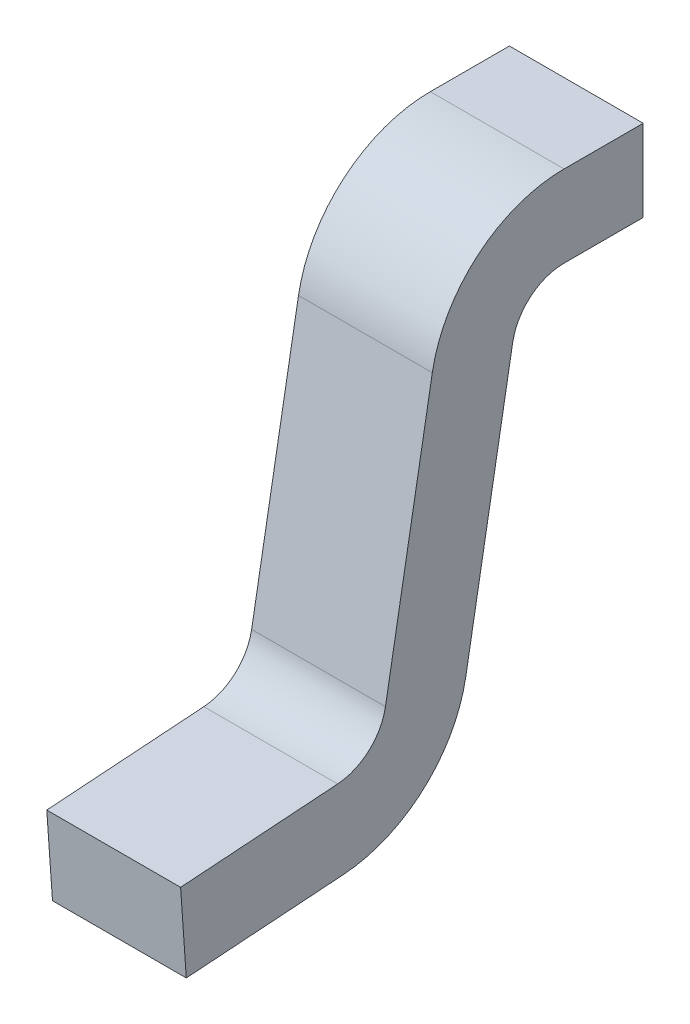
ISO-10303-21;
HEADER;
FILE_DESCRIPTION(('STEP AP214'),'2;1');
FILE_NAME('part.step','',(''),(''),'','','');
FILE_SCHEMA(('AUTOMOTIVE_DESIGN { 1 0 10303 214 1 1 1 1 }'));
ENDSEC;
DATA;
#1=APPLICATION_CONTEXT('core data for automotive mechanical design processes');
#2=APPLICATION_PROTOCOL_DEFINITION('international standard','automotive_design',2000,#1);
#3=PRODUCT_CONTEXT('',#1,'mechanical');
#4=PRODUCT('Part','Part','',(#3));
#5=PRODUCT_RELATED_PRODUCT_CATEGORY('part','',(#4));
#6=PRODUCT_DEFINITION_FORMATION('','',#4);
#7=PRODUCT_DEFINITION_CONTEXT('part definition',#1,'design');
#8=PRODUCT_DEFINITION('design','',#6,#7);
#9=PRODUCT_DEFINITION_SHAPE('','',#8);
#10=(LENGTH_UNIT() NAMED_UNIT(*) SI_UNIT(.MILLI.,.METRE.));
#11=(NAMED_UNIT(*) PLANE_ANGLE_UNIT() SI_UNIT($,.RADIAN.));
#12=(NAMED_UNIT(*) SI_UNIT($,.STERADIAN.) SOLID_ANGLE_UNIT());
#13=UNCERTAINTY_MEASURE_WITH_UNIT(LENGTH_MEASURE(1.E-05),#10,'distance_accuracy_value','');
#14=(GEOMETRIC_REPRESENTATION_CONTEXT(3) GLOBAL_UNCERTAINTY_ASSIGNED_CONTEXT((#13)) GLOBAL_UNIT_ASSIGNED_CONTEXT((#10,
#11,#12)) REPRESENTATION_CONTEXT('',''));
#15=CARTESIAN_POINT('',(0.,0.,0.));
#16=DIRECTION('',(0.,0.,1.));
#17=DIRECTION('',(1.,0.,0.));
#18=AXIS2_PLACEMENT_3D('',#15,#16,#17);
#19=CARTESIAN_POINT('',(-0.205,0.,0.));
#20=DIRECTION('',(1.,0.,0.));
#21=DIRECTION('',(0.,0.,-1.));
#22=AXIS2_PLACEMENT_3D('',#19,#20,#21);
#23=PLANE('',#22);
#24=CARTESIAN_POINT('',(-0.205,0.1926532032769,0.3823549532155));
#25=DIRECTION('',(-1.,0.,0.));
#26=DIRECTION('',(0.,-0.173648177666902,-0.984807753012213));
#27=AXIS2_PLACEMENT_3D('',#24,#25,#26);
#28=CIRCLE('',#27,0.41);
#29=CARTESIAN_POINT('',(-0.205,0.1214574504335,-0.02141622551949));
#30=VERTEX_POINT('',#29);
#31=CARTESIAN_POINT('',(-0.205,-0.2163480573296,0.3537547989804));
#32=VERTEX_POINT('',#31);
#33=EDGE_CURVE('E11',#30,#32,#28,.T.);
#34=ORIENTED_EDGE('',*,*,#33,.T.);
#35=DIRECTION('',(0.,0.0697564737441317,-0.997564050259824));
#36=VECTOR('',#35,1.);
#37=CARTESIAN_POINT('',(-0.205,-0.25,0.835));
#38=LINE('',#37,#36);
#39=CARTESIAN_POINT('',(-0.205,-0.25,0.835));
#40=VERTEX_POINT('',#39);
#41=EDGE_CURVE('E195',#40,#32,#38,.T.);
#42=ORIENTED_EDGE('',*,*,#41,.F.);
#43=DIRECTION('',(0.,-0.997564050259824,-0.069756473744132));
#44=VECTOR('',#43,1.);
#45=CARTESIAN_POINT('',(-0.205,-0.0006089874350439,0.852439118436));
#46=LINE('',#45,#44);
#47=CARTESIAN_POINT('',(-0.205,-0.0006089874350439,0.852439118436));
#48=VERTEX_POINT('',#47);
#49=EDGE_CURVE('E187',#48,#40,#46,.T.);
#50=ORIENTED_EDGE('',*,*,#49,.F.);
#51=DIRECTION('',(0.,-0.0697564737441316,0.997564050259824));
#52=VECTOR('',#51,1.);
#53=CARTESIAN_POINT('',(-0.205,0.03304295523537,0.3711939174165));
#54=LINE('',#53,#52);
#55=CARTESIAN_POINT('',(-0.205,0.03304295523537,0.3711939174165));
#56=VERTEX_POINT('',#55);
#57=EDGE_CURVE('E179',#56,#48,#54,.T.);
#58=ORIENTED_EDGE('',*,*,#57,.F.);
#59=CARTESIAN_POINT('',(-0.205,0.1926532032769,0.3823549532155));
#60=DIRECTION('',(1.,0.,0.));
#61=DIRECTION('',(0.,-0.997564050259824,-0.0697564737441317));
#62=AXIS2_PLACEMENT_3D('',#59,#60,#61);
#63=CIRCLE('',#62,0.16);
#64=CARTESIAN_POINT('',(-0.205,0.1648694948502,0.2247857127336));
#65=VERTEX_POINT('',#64);
#66=EDGE_CURVE('E167',#56,#65,#63,.T.);
#67=ORIENTED_EDGE('',*,*,#66,.T.);
#68=DIRECTION('',(0.,0.984807753012213,-0.173648177666902));
#69=VECTOR('',#68,1.);
#70=CARTESIAN_POINT('',(-0.205,0.1648694948502,0.2247857127336));
#71=LINE('',#70,#69);
#72=CARTESIAN_POINT('',(-0.205,0.9791957528434,0.08119802234999));
#73=VERTEX_POINT('',#72);
#74=EDGE_CURVE('E156',#65,#73,#71,.T.);
#75=ORIENTED_EDGE('',*,*,#74,.T.);
#76=CARTESIAN_POINT('',(-0.205,0.908,-0.322573156385));
#77=DIRECTION('',(-1.,0.,0.));
#78=DIRECTION('',(0.,0.173648177666902,0.984807753012213));
#79=AXIS2_PLACEMENT_3D('',#76,#77,#78);
#80=CIRCLE('',#79,0.41);
#81=CARTESIAN_POINT('',(-0.205,1.318,-0.322573156385));
#82=VERTEX_POINT('',#81);
#83=EDGE_CURVE('E148',#73,#82,#80,.T.);
#84=ORIENTED_EDGE('',*,*,#83,.T.);
#85=DIRECTION('',(0.,0.,1.));
#86=VECTOR('',#85,1.);
#87=CARTESIAN_POINT('',(-0.205,1.318,-0.565));
#88=LINE('',#87,#86);
#89=CARTESIAN_POINT('',(-0.205,1.318,-0.565));
#90=VERTEX_POINT('',#89);
#91=EDGE_CURVE('E137',#90,#82,#88,.T.);
#92=ORIENTED_EDGE('',*,*,#91,.F.);
#93=DIRECTION('',(0.,1.,0.));
#94=VECTOR('',#93,1.);
#95=CARTESIAN_POINT('',(-0.205,1.068,-0.565));
#96=LINE('',#95,#94);
#97=CARTESIAN_POINT('',(-0.205,1.068,-0.565));
#98=VERTEX_POINT('',#97);
#99=EDGE_CURVE('E112',#98,#90,#96,.T.);
#100=ORIENTED_EDGE('',*,*,#99,.F.);
#101=DIRECTION('',(0.,0.,-1.));
#102=VECTOR('',#101,1.);
#103=CARTESIAN_POINT('',(-0.205,1.068,-0.322573156385));
#104=LINE('',#103,#102);
#105=CARTESIAN_POINT('',(-0.205,1.068,-0.322573156385));
#106=VERTEX_POINT('',#105);
#107=EDGE_CURVE('E105',#106,#98,#104,.T.);
#108=ORIENTED_EDGE('',*,*,#107,.F.);
#109=CARTESIAN_POINT('',(-0.205,0.908,-0.322573156385));
#110=DIRECTION('',(1.,0.,0.));
#111=DIRECTION('',(0.,1.,0.));
#112=AXIS2_PLACEMENT_3D('',#109,#110,#111);
#113=CIRCLE('',#112,0.16);
#114=CARTESIAN_POINT('',(-0.205,0.9357837084267,-0.1650039159031));
#115=VERTEX_POINT('',#114);
#116=EDGE_CURVE('E116',#106,#115,#113,.T.);
#117=ORIENTED_EDGE('',*,*,#116,.T.);
#118=DIRECTION('',(0.,-0.984807753012213,0.173648177666902));
#119=VECTOR('',#118,1.);
#120=CARTESIAN_POINT('',(-0.205,0.9357837084267,-0.1650039159031));
#121=LINE('',#120,#119);
#122=EDGE_CURVE('E190',#115,#30,#121,.T.);
#123=ORIENTED_EDGE('',*,*,#122,.T.);
#124=EDGE_LOOP('',(#34,#42,#50,#58,#67,#75,#84,#92,#100,#108,#117,#123));
#125=FACE_BOUND('',#124,.T.);
#126=ADVANCED_FACE('F17',(#125),#23,.F.);
#127=CARTESIAN_POINT('',(-0.205,-0.1940031679098,0.03420799284542));
#128=DIRECTION('',(0.,-0.173648177666902,-0.984807753012213));
#129=DIRECTION('',(0.,0.984807753012213,-0.173648177666902));
#130=AXIS2_PLACEMENT_3D('',#127,#128,#129);
#131=PLANE('',#130);
#132=DIRECTION('',(1.,0.,0.));
#133=VECTOR('',#132,1.);
#134=CARTESIAN_POINT('',(-0.205,0.1214574504335,-0.02141622551949));
#135=LINE('',#134,#133);
#136=CARTESIAN_POINT('',(0.205,0.1214574504335,-0.02141622551949));
#137=VERTEX_POINT('',#136);
#138=EDGE_CURVE('E24',#30,#137,#135,.T.);
#139=ORIENTED_EDGE('',*,*,#138,.F.);
#140=ORIENTED_EDGE('',*,*,#122,.F.);
#141=DIRECTION('',(1.,0.,0.));
#142=VECTOR('',#141,1.);
#143=CARTESIAN_POINT('',(-0.205,0.9357837084267,-0.1650039159031));
#144=LINE('',#143,#142);
#145=CARTESIAN_POINT('',(0.205,0.9357837084267,-0.1650039159031));
#146=VERTEX_POINT('',#145);
#147=EDGE_CURVE('E123',#115,#146,#144,.T.);
#148=ORIENTED_EDGE('',*,*,#147,.T.);
#149=DIRECTION('',(0.,0.984807753012213,-0.173648177666902));
#150=VECTOR('',#149,1.);
#151=CARTESIAN_POINT('',(0.205,0.1214574504335,-0.02141622551949));
#152=LINE('',#151,#150);
#153=EDGE_CURVE('E169',#137,#146,#152,.T.);
#154=ORIENTED_EDGE('',*,*,#153,.F.);
#155=EDGE_LOOP('',(#139,#140,#148,#154));
#156=FACE_BOUND('',#155,.T.);
#157=ADVANCED_FACE('F235',(#156),#131,.T.);
#158=CARTESIAN_POINT('',(0.205,0.,0.));
#159=DIRECTION('',(1.,0.,0.));
#160=DIRECTION('',(0.,0.,-1.));
#161=AXIS2_PLACEMENT_3D('',#158,#159,#160);
#162=PLANE('',#161);
#163=CARTESIAN_POINT('',(0.205,0.1926532032769,0.3823549532155));
#164=DIRECTION('',(1.,0.,0.));
#165=DIRECTION('',(0.,-0.997564050259824,-0.0697564737441317));
#166=AXIS2_PLACEMENT_3D('',#163,#164,#165);
#167=CIRCLE('',#166,0.16);
#168=CARTESIAN_POINT('',(0.205,0.03304295523537,0.3711939174165));
#169=VERTEX_POINT('',#168);
#170=CARTESIAN_POINT('',(0.205,0.1648694948502,0.2247857127336));
#171=VERTEX_POINT('',#170);
#172=EDGE_CURVE('E192',#169,#171,#167,.T.);
#173=ORIENTED_EDGE('',*,*,#172,.F.);
#174=DIRECTION('',(0.,-0.0697564737441316,0.997564050259824));
#175=VECTOR('',#174,1.);
#176=CARTESIAN_POINT('',(0.205,0.03304295523537,0.3711939174165));
#177=LINE('',#176,#175);
#178=CARTESIAN_POINT('',(0.205,-0.0006089874350439,0.852439118436));
#179=VERTEX_POINT('',#178);
#180=EDGE_CURVE('E183',#169,#179,#177,.T.);
#181=ORIENTED_EDGE('',*,*,#180,.T.);
#182=DIRECTION('',(0.,-0.997564050259824,-0.069756473744132));
#183=VECTOR('',#182,1.);
#184=CARTESIAN_POINT('',(0.205,-0.0006089874350439,0.852439118436));
#185=LINE('',#184,#183);
#186=CARTESIAN_POINT('',(0.205,-0.25,0.835));
#187=VERTEX_POINT('',#186);
#188=EDGE_CURVE('E172',#179,#187,#185,.T.);
#189=ORIENTED_EDGE('',*,*,#188,.T.);
#190=DIRECTION('',(0.,0.0697564737441317,-0.997564050259824));
#191=VECTOR('',#190,1.);
#192=CARTESIAN_POINT('',(0.205,-0.25,0.835));
#193=LINE('',#192,#191);
#194=CARTESIAN_POINT('',(0.205,-0.2163480573296,0.3537547989804));
#195=VERTEX_POINT('',#194);
#196=EDGE_CURVE('E159',#187,#195,#193,.T.);
#197=ORIENTED_EDGE('',*,*,#196,.T.);
#198=CARTESIAN_POINT('',(0.205,0.1926532032769,0.3823549532155));
#199=DIRECTION('',(-1.,0.,0.));
#200=DIRECTION('',(0.,-0.173648177666902,-0.984807753012213));
#201=AXIS2_PLACEMENT_3D('',#198,#199,#200);
#202=CIRCLE('',#201,0.41);
#203=EDGE_CURVE('E145',#137,#195,#202,.T.);
#204=ORIENTED_EDGE('',*,*,#203,.F.);
#205=ORIENTED_EDGE('',*,*,#153,.T.);
#206=CARTESIAN_POINT('',(0.205,0.908,-0.322573156385));
#207=DIRECTION('',(1.,0.,0.));
#208=DIRECTION('',(0.,1.,0.));
#209=AXIS2_PLACEMENT_3D('',#206,#207,#208);
#210=CIRCLE('',#209,0.16);
#211=CARTESIAN_POINT('',(0.205,1.068,-0.322573156385));
#212=VERTEX_POINT('',#211);
#213=EDGE_CURVE('E135',#212,#146,#210,.T.);
#214=ORIENTED_EDGE('',*,*,#213,.F.);
#215=DIRECTION('',(0.,0.,-1.));
#216=VECTOR('',#215,1.);
#217=CARTESIAN_POINT('',(0.205,1.068,-0.322573156385));
#218=LINE('',#217,#216);
#219=CARTESIAN_POINT('',(0.205,1.068,-0.565));
#220=VERTEX_POINT('',#219);
#221=EDGE_CURVE('E107',#212,#220,#218,.T.);
#222=ORIENTED_EDGE('',*,*,#221,.T.);
#223=DIRECTION('',(0.,1.,0.));
#224=VECTOR('',#223,1.);
#225=CARTESIAN_POINT('',(0.205,1.068,-0.565));
#226=LINE('',#225,#224);
#227=CARTESIAN_POINT('',(0.205,1.318,-0.565));
#228=VERTEX_POINT('',#227);
#229=EDGE_CURVE('E140',#220,#228,#226,.T.);
#230=ORIENTED_EDGE('',*,*,#229,.T.);
#231=DIRECTION('',(0.,0.,1.));
#232=VECTOR('',#231,1.);
#233=CARTESIAN_POINT('',(0.205,1.318,-0.565));
#234=LINE('',#233,#232);
#235=CARTESIAN_POINT('',(0.205,1.318,-0.322573156385));
#236=VERTEX_POINT('',#235);
#237=EDGE_CURVE('E151',#228,#236,#234,.T.);
#238=ORIENTED_EDGE('',*,*,#237,.T.);
#239=CARTESIAN_POINT('',(0.205,0.908,-0.322573156385));
#240=DIRECTION('',(-1.,0.,0.));
#241=DIRECTION('',(0.,0.173648177666902,0.984807753012213));
#242=AXIS2_PLACEMENT_3D('',#239,#240,#241);
#243=CIRCLE('',#242,0.41);
#244=CARTESIAN_POINT('',(0.205,0.9791957528434,0.08119802234999));
#245=VERTEX_POINT('',#244);
#246=EDGE_CURVE('E177',#245,#236,#243,.T.);
#247=ORIENTED_EDGE('',*,*,#246,.F.);
#248=DIRECTION('',(0.,-0.984807753012213,0.173648177666902));
#249=VECTOR('',#248,1.);
#250=CARTESIAN_POINT('',(0.205,0.9791957528434,0.08119802234999));
#251=LINE('',#250,#249);
#252=EDGE_CURVE('E174',#245,#171,#251,.T.);
#253=ORIENTED_EDGE('',*,*,#252,.T.);
#254=EDGE_LOOP('',(#173,#181,#189,#197,#204,#205,#214,#222,#230,#238,#247,#253));
#255=FACE_BOUND('',#254,.T.);
#256=ADVANCED_FACE('F228',(#255),#162,.T.);
#257=CARTESIAN_POINT('',(-0.205,0.04341204441673,0.2462019382531));
#258=DIRECTION('',(0.,0.173648177666902,0.984807753012213));
#259=DIRECTION('',(0.,-0.984807753012213,0.173648177666902));
#260=AXIS2_PLACEMENT_3D('',#257,#258,#259);
#261=PLANE('',#260);
#262=DIRECTION('',(1.,0.,0.));
#263=VECTOR('',#262,1.);
#264=CARTESIAN_POINT('',(-0.205,0.1648694948502,0.2247857127336));
#265=LINE('',#264,#263);
#266=EDGE_CURVE('E185',#65,#171,#265,.T.);
#267=ORIENTED_EDGE('',*,*,#266,.T.);
#268=ORIENTED_EDGE('',*,*,#252,.F.);
#269=DIRECTION('',(1.,0.,0.));
#270=VECTOR('',#269,1.);
#271=CARTESIAN_POINT('',(-0.205,0.9791957528434,0.08119802234999));
#272=LINE('',#271,#270);
#273=EDGE_CURVE('E161',#73,#245,#272,.T.);
#274=ORIENTED_EDGE('',*,*,#273,.F.);
#275=ORIENTED_EDGE('',*,*,#74,.F.);
#276=EDGE_LOOP('',(#267,#268,#274,#275));
#277=FACE_BOUND('',#276,.T.);
#278=ADVANCED_FACE('F223',(#277),#261,.T.);
#279=CARTESIAN_POINT('',(-0.205,0.908,-0.322573156385));
#280=DIRECTION('',(-1.,0.,0.));
#281=DIRECTION('',(0.,0.173648177666902,0.984807753012213));
#282=AXIS2_PLACEMENT_3D('',#279,#280,#281);
#283=CYLINDRICAL_SURFACE('',#282,0.41);
#284=ORIENTED_EDGE('',*,*,#246,.T.);
#285=DIRECTION('',(1.,0.,0.));
#286=VECTOR('',#285,1.);
#287=CARTESIAN_POINT('',(-0.205,1.318,-0.322573156385));
#288=LINE('',#287,#286);
#289=EDGE_CURVE('E164',#82,#236,#288,.T.);
#290=ORIENTED_EDGE('',*,*,#289,.F.);
#291=ORIENTED_EDGE('',*,*,#83,.F.);
#292=ORIENTED_EDGE('',*,*,#273,.T.);
#293=EDGE_LOOP('',(#284,#290,#291,#292));
#294=FACE_BOUND('',#293,.T.);
#295=ADVANCED_FACE('F226',(#294),#283,.T.);
#296=CARTESIAN_POINT('',(-0.205,1.318,-0.565));
#297=DIRECTION('',(0.,1.,0.));
#298=DIRECTION('',(0.,0.,1.));
#299=AXIS2_PLACEMENT_3D('',#296,#297,#298);
#300=PLANE('',#299);
#301=ORIENTED_EDGE('',*,*,#289,.T.);
#302=ORIENTED_EDGE('',*,*,#237,.F.);
#303=DIRECTION('',(1.,0.,0.));
#304=VECTOR('',#303,1.);
#305=CARTESIAN_POINT('',(-0.205,1.318,-0.565));
#306=LINE('',#305,#304);
#307=EDGE_CURVE('E154',#90,#228,#306,.T.);
#308=ORIENTED_EDGE('',*,*,#307,.F.);
#309=ORIENTED_EDGE('',*,*,#91,.T.);
#310=EDGE_LOOP('',(#301,#302,#308,#309));
#311=FACE_BOUND('',#310,.T.);
#312=ADVANCED_FACE('F232',(#311),#300,.T.);
#313=CARTESIAN_POINT('',(-0.205,1.068,-0.565));
#314=DIRECTION('',(0.,0.,-1.));
#315=DIRECTION('',(0.,1.,0.));
#316=AXIS2_PLACEMENT_3D('',#313,#314,#315);
#317=PLANE('',#316);
#318=ORIENTED_EDGE('',*,*,#307,.T.);
#319=ORIENTED_EDGE('',*,*,#229,.F.);
#320=DIRECTION('',(1.,0.,0.));
#321=VECTOR('',#320,1.);
#322=CARTESIAN_POINT('',(-0.205,1.068,-0.565));
#323=LINE('',#322,#321);
#324=EDGE_CURVE('E143',#98,#220,#323,.T.);
#325=ORIENTED_EDGE('',*,*,#324,.F.);
#326=ORIENTED_EDGE('',*,*,#99,.T.);
#327=EDGE_LOOP('',(#318,#319,#325,#326));
#328=FACE_BOUND('',#327,.T.);
#329=ADVANCED_FACE('F234',(#328),#317,.T.);
#330=CARTESIAN_POINT('',(-0.205,1.068,-0.1883172153966));
#331=DIRECTION('',(0.,-1.,0.));
#332=DIRECTION('',(0.,0.,-1.));
#333=AXIS2_PLACEMENT_3D('',#330,#331,#332);
#334=PLANE('',#333);
#335=ORIENTED_EDGE('',*,*,#324,.T.);
#336=ORIENTED_EDGE('',*,*,#221,.F.);
#337=DIRECTION('',(1.,0.,0.));
#338=VECTOR('',#337,1.);
#339=CARTESIAN_POINT('',(-0.205,1.068,-0.322573156385));
#340=LINE('',#339,#338);
#341=EDGE_CURVE('E102',#106,#212,#340,.T.);
#342=ORIENTED_EDGE('',*,*,#341,.F.);
#343=ORIENTED_EDGE('',*,*,#107,.T.);
#344=EDGE_LOOP('',(#335,#336,#342,#343));
#345=FACE_BOUND('',#344,.T.);
#346=ADVANCED_FACE('F104',(#345),#334,.T.);
#347=CARTESIAN_POINT('',(-0.205,0.908,-0.322573156385));
#348=DIRECTION('',(1.,0.,0.));
#349=DIRECTION('',(0.,1.,0.));
#350=AXIS2_PLACEMENT_3D('',#347,#348,#349);
#351=CYLINDRICAL_SURFACE('',#350,0.16);
#352=ORIENTED_EDGE('',*,*,#213,.T.);
#353=ORIENTED_EDGE('',*,*,#147,.F.);
#354=ORIENTED_EDGE('',*,*,#116,.F.);
#355=ORIENTED_EDGE('',*,*,#341,.T.);
#356=EDGE_LOOP('',(#352,#353,#354,#355));
#357=FACE_BOUND('',#356,.T.);
#358=ADVANCED_FACE('F122',(#357),#351,.F.);
#359=CARTESIAN_POINT('',(-0.205,0.1926532032769,0.3823549532155));
#360=DIRECTION('',(1.,0.,0.));
#361=DIRECTION('',(0.,-0.997564050259824,-0.0697564737441317));
#362=AXIS2_PLACEMENT_3D('',#359,#360,#361);
#363=CYLINDRICAL_SURFACE('',#362,0.16);
#364=ORIENTED_EDGE('',*,*,#172,.T.);
#365=ORIENTED_EDGE('',*,*,#266,.F.);
#366=ORIENTED_EDGE('',*,*,#66,.F.);
#367=DIRECTION('',(1.,0.,0.));
#368=VECTOR('',#367,1.);
#369=CARTESIAN_POINT('',(-0.205,0.03304295523537,0.3711939174165));
#370=LINE('',#369,#368);
#371=EDGE_CURVE('E203',#56,#169,#370,.T.);
#372=ORIENTED_EDGE('',*,*,#371,.T.);
#373=EDGE_LOOP('',(#364,#365,#366,#372));
#374=FACE_BOUND('',#373,.T.);
#375=ADVANCED_FACE('F218',(#374),#363,.F.);
#376=CARTESIAN_POINT('',(-0.205,0.0417629120821,0.2464927247784));
#377=DIRECTION('',(0.,0.997564050259824,0.0697564737441317));
#378=DIRECTION('',(0.,-0.0697564737441317,0.997564050259824));
#379=AXIS2_PLACEMENT_3D('',#376,#377,#378);
#380=PLANE('',#379);
#381=DIRECTION('',(1.,0.,0.));
#382=VECTOR('',#381,1.);
#383=CARTESIAN_POINT('',(-0.205,-0.0006089874350439,0.852439118436));
#384=LINE('',#383,#382);
#385=EDGE_CURVE('E119',#48,#179,#384,.T.);
#386=ORIENTED_EDGE('',*,*,#385,.T.);
#387=ORIENTED_EDGE('',*,*,#180,.F.);
#388=ORIENTED_EDGE('',*,*,#371,.F.);
#389=ORIENTED_EDGE('',*,*,#57,.T.);
#390=EDGE_LOOP('',(#386,#387,#388,#389));
#391=FACE_BOUND('',#390,.T.);
#392=ADVANCED_FACE('F214',(#391),#380,.T.);
#393=CARTESIAN_POINT('',(-0.205,-0.0006089874350439,0.852439118436));
#394=DIRECTION('',(0.,-0.0697564737441317,0.997564050259824));
#395=DIRECTION('',(0.,-0.997564050259824,-0.0697564737441317));
#396=AXIS2_PLACEMENT_3D('',#393,#394,#395);
#397=PLANE('',#396);
#398=DIRECTION('',(1.,0.,0.));
#399=VECTOR('',#398,1.);
#400=CARTESIAN_POINT('',(-0.205,-0.25,0.835));
#401=LINE('',#400,#399);
#402=EDGE_CURVE('E124',#40,#187,#401,.T.);
#403=ORIENTED_EDGE('',*,*,#402,.T.);
#404=ORIENTED_EDGE('',*,*,#188,.F.);
#405=ORIENTED_EDGE('',*,*,#385,.F.);
#406=ORIENTED_EDGE('',*,*,#49,.T.);
#407=EDGE_LOOP('',(#403,#404,#405,#406));
#408=FACE_BOUND('',#407,.T.);
#409=ADVANCED_FACE('F210',(#408),#397,.T.);
#410=CARTESIAN_POINT('',(-0.205,-0.25,0.835));
#411=DIRECTION('',(0.,-0.997564050259824,-0.0697564737441317));
#412=DIRECTION('',(0.,0.0697564737441317,-0.997564050259824));
#413=AXIS2_PLACEMENT_3D('',#410,#411,#412);
#414=PLANE('',#413);
#415=DIRECTION('',(1.,0.,0.));
#416=VECTOR('',#415,1.);
#417=CARTESIAN_POINT('',(-0.205,-0.2163480573296,0.3537547989804));
#418=LINE('',#417,#416);
#419=EDGE_CURVE('E129',#32,#195,#418,.T.);
#420=ORIENTED_EDGE('',*,*,#419,.T.);
#421=ORIENTED_EDGE('',*,*,#196,.F.);
#422=ORIENTED_EDGE('',*,*,#402,.F.);
#423=ORIENTED_EDGE('',*,*,#41,.T.);
#424=EDGE_LOOP('',(#420,#421,#422,#423));
#425=FACE_BOUND('',#424,.T.);
#426=ADVANCED_FACE('F205',(#425),#414,.T.);
#427=CARTESIAN_POINT('',(-0.205,0.1926532032769,0.3823549532155));
#428=DIRECTION('',(-1.,0.,0.));
#429=DIRECTION('',(0.,-0.173648177666902,-0.984807753012213));
#430=AXIS2_PLACEMENT_3D('',#427,#428,#429);
#431=CYLINDRICAL_SURFACE('',#430,0.41);
#432=ORIENTED_EDGE('',*,*,#203,.T.);
#433=ORIENTED_EDGE('',*,*,#419,.F.);
#434=ORIENTED_EDGE('',*,*,#33,.F.);
#435=ORIENTED_EDGE('',*,*,#138,.T.);
#436=EDGE_LOOP('',(#432,#433,#434,#435));
#437=FACE_BOUND('',#436,.T.);
#438=ADVANCED_FACE('F198',(#437),#431,.T.);
#439=CLOSED_SHELL('',(#126,#157,#256,#278,#295,#312,#329,#346,#358,#375,#392,#409,#426,#438));
#440=MANIFOLD_SOLID_BREP('B1',#439);
#441=ADVANCED_BREP_SHAPE_REPRESENTATION('',(#18,#440),#14);
#442=SHAPE_DEFINITION_REPRESENTATION(#9,#441);
ENDSEC;
END-ISO-10303-21;
